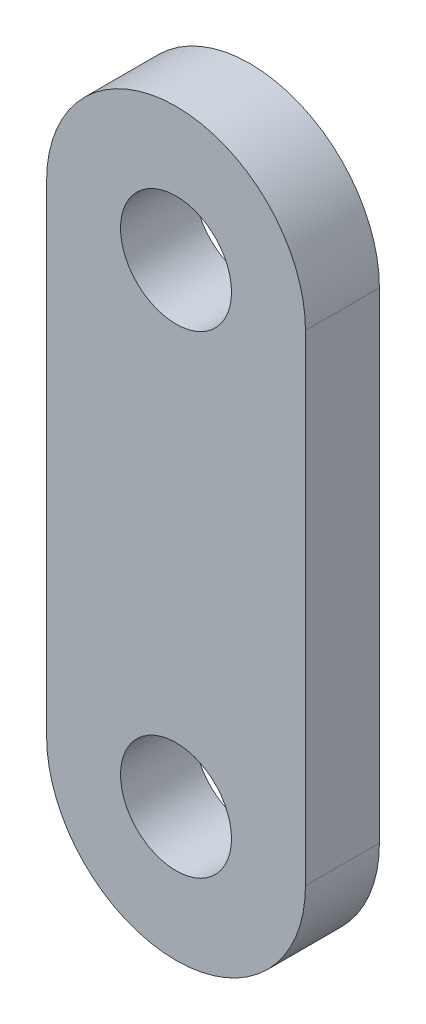
ISO-10303-21;
HEADER;
FILE_DESCRIPTION(('STEP AP214'),'2;1');
FILE_NAME('part.step','',(''),(''),'','','');
FILE_SCHEMA(('AUTOMOTIVE_DESIGN { 1 0 10303 214 1 1 1 1 }'));
ENDSEC;
DATA;
#1=APPLICATION_CONTEXT('core data for automotive mechanical design processes');
#2=APPLICATION_PROTOCOL_DEFINITION('international standard','automotive_design',2000,#1);
#3=PRODUCT_CONTEXT('',#1,'mechanical');
#4=PRODUCT('Part','Part','',(#3));
#5=PRODUCT_RELATED_PRODUCT_CATEGORY('part','',(#4));
#6=PRODUCT_DEFINITION_FORMATION('','',#4);
#7=PRODUCT_DEFINITION_CONTEXT('part definition',#1,'design');
#8=PRODUCT_DEFINITION('design','',#6,#7);
#9=PRODUCT_DEFINITION_SHAPE('','',#8);
#10=(LENGTH_UNIT() NAMED_UNIT(*) SI_UNIT(.MILLI.,.METRE.));
#11=(NAMED_UNIT(*) PLANE_ANGLE_UNIT() SI_UNIT($,.RADIAN.));
#12=(NAMED_UNIT(*) SI_UNIT($,.STERADIAN.) SOLID_ANGLE_UNIT());
#13=UNCERTAINTY_MEASURE_WITH_UNIT(LENGTH_MEASURE(1.E-05),#10,'distance_accuracy_value','');
#14=(GEOMETRIC_REPRESENTATION_CONTEXT(3) GLOBAL_UNCERTAINTY_ASSIGNED_CONTEXT((#13)) GLOBAL_UNIT_ASSIGNED_CONTEXT((#10,
#11,#12)) REPRESENTATION_CONTEXT('',''));
#15=CARTESIAN_POINT('',(0.,0.,0.));
#16=DIRECTION('',(0.,0.,1.));
#17=DIRECTION('',(1.,0.,0.));
#18=AXIS2_PLACEMENT_3D('',#15,#16,#17);
#19=CARTESIAN_POINT('',(0.,-10.31875,-1.5875));
#20=DIRECTION('',(0.,0.,-1.));
#21=DIRECTION('',(-1.,0.,0.));
#22=AXIS2_PLACEMENT_3D('',#19,#20,#21);
#23=CYLINDRICAL_SURFACE('',#22,5.55625);
#24=DIRECTION('',(0.,0.,-1.));
#25=VECTOR('',#24,1.);
#26=CARTESIAN_POINT('',(-5.55625,-10.31875,1.5875));
#27=LINE('',#26,#25);
#28=CARTESIAN_POINT('',(-5.55625,-10.31875,-1.5875));
#29=VERTEX_POINT('',#28);
#30=CARTESIAN_POINT('',(-5.55625,-10.31875,1.5875));
#31=VERTEX_POINT('',#30);
#32=EDGE_CURVE('E84',#29,#31,#27,.F.);
#33=ORIENTED_EDGE('',*,*,#32,.F.);
#34=CARTESIAN_POINT('',(0.,-10.31875,-1.5875));
#35=DIRECTION('',(0.,0.,1.));
#36=DIRECTION('',(1.,0.,0.));
#37=AXIS2_PLACEMENT_3D('',#34,#35,#36);
#38=CIRCLE('',#37,5.55625);
#39=CARTESIAN_POINT('',(5.55625,-10.31875,-1.5875));
#40=VERTEX_POINT('',#39);
#41=EDGE_CURVE('E42',#40,#29,#38,.F.);
#42=ORIENTED_EDGE('',*,*,#41,.F.);
#43=DIRECTION('',(0.,0.,-1.));
#44=VECTOR('',#43,1.);
#45=CARTESIAN_POINT('',(5.55625,-10.31875,1.5875));
#46=LINE('',#45,#44);
#47=CARTESIAN_POINT('',(5.55625,-10.31875,1.5875));
#48=VERTEX_POINT('',#47);
#49=EDGE_CURVE('E109',#48,#40,#46,.T.);
#50=ORIENTED_EDGE('',*,*,#49,.F.);
#51=CARTESIAN_POINT('',(0.,-10.31875,1.5875));
#52=DIRECTION('',(0.,0.,1.));
#53=DIRECTION('',(1.,0.,0.));
#54=AXIS2_PLACEMENT_3D('',#51,#52,#53);
#55=CIRCLE('',#54,5.55625);
#56=EDGE_CURVE('E11',#31,#48,#55,.T.);
#57=ORIENTED_EDGE('',*,*,#56,.F.);
#58=EDGE_LOOP('',(#33,#42,#50,#57));
#59=FACE_BOUND('',#58,.T.);
#60=ADVANCED_FACE('F34',(#59),#23,.T.);
#61=CARTESIAN_POINT('',(0.,10.31875,1.5875));
#62=DIRECTION('',(0.,0.,-1.));
#63=DIRECTION('',(-1.,0.,0.));
#64=AXIS2_PLACEMENT_3D('',#61,#62,#63);
#65=CYLINDRICAL_SURFACE('',#64,5.55625);
#66=DIRECTION('',(0.,0.,-1.));
#67=VECTOR('',#66,1.);
#68=CARTESIAN_POINT('',(-5.55625,10.31875,1.5875));
#69=LINE('',#68,#67);
#70=CARTESIAN_POINT('',(-5.55625,10.31875,1.5875));
#71=VERTEX_POINT('',#70);
#72=CARTESIAN_POINT('',(-5.55625,10.31875,-1.5875));
#73=VERTEX_POINT('',#72);
#74=EDGE_CURVE('E77',#71,#73,#69,.T.);
#75=ORIENTED_EDGE('',*,*,#74,.F.);
#76=CARTESIAN_POINT('',(0.,10.31875,1.5875));
#77=DIRECTION('',(0.,0.,1.));
#78=DIRECTION('',(1.,0.,0.));
#79=AXIS2_PLACEMENT_3D('',#76,#77,#78);
#80=CIRCLE('',#79,5.55625);
#81=CARTESIAN_POINT('',(5.55625,10.31875,1.5875));
#82=VERTEX_POINT('',#81);
#83=EDGE_CURVE('E85',#82,#71,#80,.T.);
#84=ORIENTED_EDGE('',*,*,#83,.F.);
#85=DIRECTION('',(0.,0.,-1.));
#86=VECTOR('',#85,1.);
#87=CARTESIAN_POINT('',(5.55625,10.31875,1.5875));
#88=LINE('',#87,#86);
#89=CARTESIAN_POINT('',(5.55625,10.31875,-1.5875));
#90=VERTEX_POINT('',#89);
#91=EDGE_CURVE('E80',#90,#82,#88,.F.);
#92=ORIENTED_EDGE('',*,*,#91,.F.);
#93=CARTESIAN_POINT('',(0.,10.31875,-1.5875));
#94=DIRECTION('',(0.,0.,1.));
#95=DIRECTION('',(1.,0.,0.));
#96=AXIS2_PLACEMENT_3D('',#93,#94,#95);
#97=CIRCLE('',#96,5.55625);
#98=EDGE_CURVE('E73',#73,#90,#97,.F.);
#99=ORIENTED_EDGE('',*,*,#98,.F.);
#100=EDGE_LOOP('',(#75,#84,#92,#99));
#101=FACE_BOUND('',#100,.T.);
#102=ADVANCED_FACE('F75',(#101),#65,.T.);
#103=CARTESIAN_POINT('',(-5.55625,-15.875,1.5875));
#104=DIRECTION('',(1.,0.,0.));
#105=DIRECTION('',(0.,0.,-1.));
#106=AXIS2_PLACEMENT_3D('',#103,#104,#105);
#107=PLANE('',#106);
#108=DIRECTION('',(0.,-1.,0.));
#109=VECTOR('',#108,1.);
#110=CARTESIAN_POINT('',(-5.55625,-15.875,-1.5875));
#111=LINE('',#110,#109);
#112=EDGE_CURVE('E91',#73,#29,#111,.T.);
#113=ORIENTED_EDGE('',*,*,#112,.T.);
#114=ORIENTED_EDGE('',*,*,#32,.T.);
#115=DIRECTION('',(0.,-1.,0.));
#116=VECTOR('',#115,1.);
#117=CARTESIAN_POINT('',(-5.55625,-15.875,1.5875));
#118=LINE('',#117,#116);
#119=EDGE_CURVE('E92',#71,#31,#118,.T.);
#120=ORIENTED_EDGE('',*,*,#119,.F.);
#121=ORIENTED_EDGE('',*,*,#74,.T.);
#122=EDGE_LOOP('',(#113,#114,#120,#121));
#123=FACE_BOUND('',#122,.T.);
#124=ADVANCED_FACE('F89',(#123),#107,.F.);
#125=CARTESIAN_POINT('',(5.55625,-15.875,1.5875));
#126=DIRECTION('',(-1.,0.,0.));
#127=DIRECTION('',(0.,0.,1.));
#128=AXIS2_PLACEMENT_3D('',#125,#126,#127);
#129=PLANE('',#128);
#130=DIRECTION('',(0.,1.,0.));
#131=VECTOR('',#130,1.);
#132=CARTESIAN_POINT('',(5.55625,-15.875,1.5875));
#133=LINE('',#132,#131);
#134=EDGE_CURVE('E93',#48,#82,#133,.T.);
#135=ORIENTED_EDGE('',*,*,#134,.F.);
#136=ORIENTED_EDGE('',*,*,#49,.T.);
#137=DIRECTION('',(0.,1.,0.));
#138=VECTOR('',#137,1.);
#139=CARTESIAN_POINT('',(5.55625,-15.875,-1.5875));
#140=LINE('',#139,#138);
#141=EDGE_CURVE('E96',#40,#90,#140,.T.);
#142=ORIENTED_EDGE('',*,*,#141,.T.);
#143=ORIENTED_EDGE('',*,*,#91,.T.);
#144=EDGE_LOOP('',(#135,#136,#142,#143));
#145=FACE_BOUND('',#144,.T.);
#146=ADVANCED_FACE('F112',(#145),#129,.F.);
#147=CARTESIAN_POINT('',(0.,0.,1.5875));
#148=DIRECTION('',(0.,0.,1.));
#149=DIRECTION('',(1.,0.,0.));
#150=AXIS2_PLACEMENT_3D('',#147,#148,#149);
#151=PLANE('',#150);
#152=CARTESIAN_POINT('',(0.,10.16,1.5875));
#153=DIRECTION('',(0.,0.,1.));
#154=DIRECTION('',(1.,0.,0.));
#155=AXIS2_PLACEMENT_3D('',#152,#153,#154);
#156=CIRCLE('',#155,2.38125);
#157=CARTESIAN_POINT('',(2.38125,10.16,1.5875));
#158=VERTEX_POINT('',#157);
#159=EDGE_CURVE('E120',#158,#158,#156,.T.);
#160=ORIENTED_EDGE('',*,*,#159,.F.);
#161=EDGE_LOOP('',(#160));
#162=FACE_BOUND('',#161,.T.);
#163=CARTESIAN_POINT('',(0.,-10.16,1.5875));
#164=DIRECTION('',(0.,0.,1.));
#165=DIRECTION('',(1.,0.,0.));
#166=AXIS2_PLACEMENT_3D('',#163,#164,#165);
#167=CIRCLE('',#166,2.38125);
#168=CARTESIAN_POINT('',(2.38125,-10.16,1.5875));
#169=VERTEX_POINT('',#168);
#170=EDGE_CURVE('E101',#169,#169,#167,.T.);
#171=ORIENTED_EDGE('',*,*,#170,.F.);
#172=EDGE_LOOP('',(#171));
#173=FACE_BOUND('',#172,.T.);
#174=ORIENTED_EDGE('',*,*,#119,.T.);
#175=ORIENTED_EDGE('',*,*,#56,.T.);
#176=ORIENTED_EDGE('',*,*,#134,.T.);
#177=ORIENTED_EDGE('',*,*,#83,.T.);
#178=EDGE_LOOP('',(#174,#175,#176,#177));
#179=FACE_BOUND('',#178,.T.);
#180=ADVANCED_FACE('F113',(#162,#173,#179),#151,.T.);
#181=CARTESIAN_POINT('',(0.,0.,-1.5875));
#182=DIRECTION('',(0.,0.,1.));
#183=DIRECTION('',(1.,0.,0.));
#184=AXIS2_PLACEMENT_3D('',#181,#182,#183);
#185=PLANE('',#184);
#186=CARTESIAN_POINT('',(0.,10.16,-1.5875));
#187=DIRECTION('',(0.,0.,1.));
#188=DIRECTION('',(1.,0.,0.));
#189=AXIS2_PLACEMENT_3D('',#186,#187,#188);
#190=CIRCLE('',#189,2.38125);
#191=CARTESIAN_POINT('',(2.38125,10.16,-1.5875));
#192=VERTEX_POINT('',#191);
#193=EDGE_CURVE('E117',#192,#192,#190,.T.);
#194=ORIENTED_EDGE('',*,*,#193,.T.);
#195=EDGE_LOOP('',(#194));
#196=FACE_BOUND('',#195,.T.);
#197=CARTESIAN_POINT('',(0.,-10.16,-1.5875));
#198=DIRECTION('',(0.,0.,1.));
#199=DIRECTION('',(1.,0.,0.));
#200=AXIS2_PLACEMENT_3D('',#197,#198,#199);
#201=CIRCLE('',#200,2.38125);
#202=CARTESIAN_POINT('',(2.38125,-10.16,-1.5875));
#203=VERTEX_POINT('',#202);
#204=EDGE_CURVE('E97',#203,#203,#201,.T.);
#205=ORIENTED_EDGE('',*,*,#204,.T.);
#206=EDGE_LOOP('',(#205));
#207=FACE_BOUND('',#206,.T.);
#208=ORIENTED_EDGE('',*,*,#141,.F.);
#209=ORIENTED_EDGE('',*,*,#41,.T.);
#210=ORIENTED_EDGE('',*,*,#112,.F.);
#211=ORIENTED_EDGE('',*,*,#98,.T.);
#212=EDGE_LOOP('',(#208,#209,#210,#211));
#213=FACE_BOUND('',#212,.T.);
#214=ADVANCED_FACE('F95',(#196,#207,#213),#185,.F.);
#215=CARTESIAN_POINT('',(0.,-10.16,1.5875));
#216=DIRECTION('',(0.,0.,1.));
#217=DIRECTION('',(1.,0.,0.));
#218=AXIS2_PLACEMENT_3D('',#215,#216,#217);
#219=CYLINDRICAL_SURFACE('',#218,2.38125);
#220=ORIENTED_EDGE('',*,*,#204,.F.);
#221=EDGE_LOOP('',(#220));
#222=FACE_BOUND('',#221,.T.);
#223=ORIENTED_EDGE('',*,*,#170,.T.);
#224=EDGE_LOOP('',(#223));
#225=FACE_BOUND('',#224,.T.);
#226=ADVANCED_FACE('F131',(#222,#225),#219,.F.);
#227=CARTESIAN_POINT('',(0.,10.16,1.5875));
#228=DIRECTION('',(0.,0.,1.));
#229=DIRECTION('',(1.,0.,0.));
#230=AXIS2_PLACEMENT_3D('',#227,#228,#229);
#231=CYLINDRICAL_SURFACE('',#230,2.38125);
#232=ORIENTED_EDGE('',*,*,#193,.F.);
#233=EDGE_LOOP('',(#232));
#234=FACE_BOUND('',#233,.T.);
#235=ORIENTED_EDGE('',*,*,#159,.T.);
#236=EDGE_LOOP('',(#235));
#237=FACE_BOUND('',#236,.T.);
#238=ADVANCED_FACE('F124',(#234,#237),#231,.F.);
#239=CLOSED_SHELL('',(#60,#102,#124,#146,#180,#214,#226,#238));
#240=MANIFOLD_SOLID_BREP('B2',#239);
#241=ADVANCED_BREP_SHAPE_REPRESENTATION('',(#18,#240),#14);
#242=SHAPE_DEFINITION_REPRESENTATION(#9,#241);
ENDSEC;
END-ISO-10303-21;
